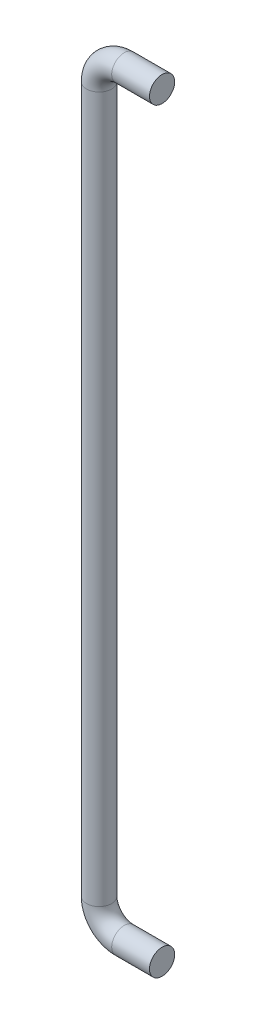
ISO-10303-21;
HEADER;
FILE_DESCRIPTION(('STEP AP214'),'2;1');
FILE_NAME('part.step','',(''),(''),'','','');
FILE_SCHEMA(('AUTOMOTIVE_DESIGN { 1 0 10303 214 1 1 1 1 }'));
ENDSEC;
DATA;
#1=APPLICATION_CONTEXT('core data for automotive mechanical design processes');
#2=APPLICATION_PROTOCOL_DEFINITION('international standard','automotive_design',2000,#1);
#3=PRODUCT_CONTEXT('',#1,'mechanical');
#4=PRODUCT('Part','Part','',(#3));
#5=PRODUCT_RELATED_PRODUCT_CATEGORY('part','',(#4));
#6=PRODUCT_DEFINITION_FORMATION('','',#4);
#7=PRODUCT_DEFINITION_CONTEXT('part definition',#1,'design');
#8=PRODUCT_DEFINITION('design','',#6,#7);
#9=PRODUCT_DEFINITION_SHAPE('','',#8);
#10=(LENGTH_UNIT() NAMED_UNIT(*) SI_UNIT(.MILLI.,.METRE.));
#11=(NAMED_UNIT(*) PLANE_ANGLE_UNIT() SI_UNIT($,.RADIAN.));
#12=(NAMED_UNIT(*) SI_UNIT($,.STERADIAN.) SOLID_ANGLE_UNIT());
#13=UNCERTAINTY_MEASURE_WITH_UNIT(LENGTH_MEASURE(1.E-05),#10,'distance_accuracy_value','');
#14=(GEOMETRIC_REPRESENTATION_CONTEXT(3) GLOBAL_UNCERTAINTY_ASSIGNED_CONTEXT((#13)) GLOBAL_UNIT_ASSIGNED_CONTEXT((#10,
#11,#12)) REPRESENTATION_CONTEXT('',''));
#15=CARTESIAN_POINT('',(0.,0.,0.));
#16=DIRECTION('',(0.,0.,1.));
#17=DIRECTION('',(1.,0.,0.));
#18=AXIS2_PLACEMENT_3D('',#15,#16,#17);
#19=CARTESIAN_POINT('',(25.,-300.,0.));
#20=DIRECTION('',(-1.,0.,0.));
#21=DIRECTION('',(0.,0.,-1.));
#22=AXIS2_PLACEMENT_3D('',#19,#20,#21);
#23=PLANE('',#22);
#24=CARTESIAN_POINT('',(25.,-300.,0.));
#25=DIRECTION('',(-1.,0.,0.));
#26=DIRECTION('',(0.,0.,-1.));
#27=AXIS2_PLACEMENT_3D('',#24,#25,#26);
#28=CIRCLE('',#27,10.);
#29=CARTESIAN_POINT('',(25.,-300.,-10.));
#30=VERTEX_POINT('',#29);
#31=EDGE_CURVE('E56',#30,#30,#28,.T.);
#32=ORIENTED_EDGE('',*,*,#31,.F.);
#33=EDGE_LOOP('',(#32));
#34=FACE_BOUND('',#33,.T.);
#35=ADVANCED_FACE('F34',(#34),#23,.F.);
#36=CARTESIAN_POINT('',(24.9999999999999,300.,0.));
#37=DIRECTION('',(1.,0.,0.));
#38=DIRECTION('',(0.,0.,-1.));
#39=AXIS2_PLACEMENT_3D('',#36,#37,#38);
#40=PLANE('',#39);
#41=CARTESIAN_POINT('',(24.9999999999999,300.,0.));
#42=DIRECTION('',(1.,0.,0.));
#43=DIRECTION('',(0.,0.,-1.));
#44=AXIS2_PLACEMENT_3D('',#41,#42,#43);
#45=CIRCLE('',#44,10.);
#46=CARTESIAN_POINT('',(24.9999999999999,300.,-10.));
#47=VERTEX_POINT('',#46);
#48=EDGE_CURVE('E10',#47,#47,#45,.T.);
#49=ORIENTED_EDGE('',*,*,#48,.T.);
#50=EDGE_LOOP('',(#49));
#51=FACE_BOUND('',#50,.T.);
#52=ADVANCED_FACE('F63',(#51),#40,.T.);
#53=CARTESIAN_POINT('',(25.,-300.,0.));
#54=DIRECTION('',(-1.,0.,0.));
#55=DIRECTION('',(0.,0.,1.));
#56=AXIS2_PLACEMENT_3D('',#53,#54,#55);
#57=CYLINDRICAL_SURFACE('',#56,10.);
#58=CARTESIAN_POINT('',(-4.99999999999983,-300.,0.));
#59=DIRECTION('',(-1.,0.,0.));
#60=DIRECTION('',(0.,0.,-1.));
#61=AXIS2_PLACEMENT_3D('',#58,#59,#60);
#62=CIRCLE('',#61,10.);
#63=CARTESIAN_POINT('',(-4.99999999999976,-310.,0.));
#64=VERTEX_POINT('',#63);
#65=EDGE_CURVE('E53',#64,#64,#62,.T.);
#66=ORIENTED_EDGE('',*,*,#65,.F.);
#67=EDGE_LOOP('',(#66));
#68=FACE_BOUND('',#67,.T.);
#69=ORIENTED_EDGE('',*,*,#31,.T.);
#70=EDGE_LOOP('',(#69));
#71=FACE_BOUND('',#70,.T.);
#72=ADVANCED_FACE('F60',(#68,#71),#57,.T.);
#73=CARTESIAN_POINT('',(-4.99999999999997,-280.,0.));
#74=DIRECTION('',(0.,0.,-1.));
#75=DIRECTION('',(-1.,0.,0.));
#76=AXIS2_PLACEMENT_3D('',#73,#74,#75);
#77=TOROIDAL_SURFACE('',#76,20.,10.);
#78=CARTESIAN_POINT('',(-25.,-280.,0.));
#79=DIRECTION('',(0.,1.,0.));
#80=DIRECTION('',(0.,0.,-1.));
#81=AXIS2_PLACEMENT_3D('',#78,#79,#80);
#82=CIRCLE('',#81,10.);
#83=CARTESIAN_POINT('',(-35.,-280.,0.));
#84=VERTEX_POINT('',#83);
#85=EDGE_CURVE('E48',#84,#84,#82,.T.);
#86=CARTESIAN_POINT('',(-4.99999999999997,-280.,0.));
#87=DIRECTION('',(0.,0.,-1.));
#88=DIRECTION('',(-1.,0.,0.));
#89=AXIS2_PLACEMENT_3D('',#86,#87,#88);
#90=CIRCLE('',#89,30.);
#91=EDGE_CURVE('',#64,#84,#90,.T.);
#92=ORIENTED_EDGE('',*,*,#65,.T.);
#93=ORIENTED_EDGE('',*,*,#85,.F.);
#94=ORIENTED_EDGE('',*,*,#91,.T.);
#95=ORIENTED_EDGE('',*,*,#91,.F.);
#96=EDGE_LOOP('',(#92,#94,#93,#95));
#97=FACE_BOUND('',#96,.T.);
#98=ADVANCED_FACE('F81',(#97),#77,.T.);
#99=CARTESIAN_POINT('',(-25.,-280.,0.));
#100=DIRECTION('',(0.,1.,0.));
#101=DIRECTION('',(-1.,0.,0.));
#102=AXIS2_PLACEMENT_3D('',#99,#100,#101);
#103=CYLINDRICAL_SURFACE('',#102,10.);
#104=CARTESIAN_POINT('',(-25.,280.,0.));
#105=DIRECTION('',(0.,1.,0.));
#106=DIRECTION('',(0.,0.,-1.));
#107=AXIS2_PLACEMENT_3D('',#104,#105,#106);
#108=CIRCLE('',#107,10.);
#109=CARTESIAN_POINT('',(-35.0000000000001,280.,0.));
#110=VERTEX_POINT('',#109);
#111=EDGE_CURVE('E44',#110,#110,#108,.T.);
#112=ORIENTED_EDGE('',*,*,#111,.F.);
#113=EDGE_LOOP('',(#112));
#114=FACE_BOUND('',#113,.T.);
#115=ORIENTED_EDGE('',*,*,#85,.T.);
#116=EDGE_LOOP('',(#115));
#117=FACE_BOUND('',#116,.T.);
#118=ADVANCED_FACE('F75',(#114,#117),#103,.T.);
#119=CARTESIAN_POINT('',(-5.00000000000005,280.,0.));
#120=DIRECTION('',(0.,0.,-1.));
#121=DIRECTION('',(-1.,0.,0.));
#122=AXIS2_PLACEMENT_3D('',#119,#120,#121);
#123=TOROIDAL_SURFACE('',#122,20.,10.);
#124=CARTESIAN_POINT('',(-5.00000000000202,300.,0.));
#125=DIRECTION('',(1.,0.,0.));
#126=DIRECTION('',(0.,0.,-1.));
#127=AXIS2_PLACEMENT_3D('',#124,#125,#126);
#128=CIRCLE('',#127,10.);
#129=CARTESIAN_POINT('',(-5.000000000003,310.,0.));
#130=VERTEX_POINT('',#129);
#131=EDGE_CURVE('E40',#130,#130,#128,.T.);
#132=CARTESIAN_POINT('',(-5.00000000000005,280.,0.));
#133=DIRECTION('',(0.,0.,-1.));
#134=DIRECTION('',(-1.,0.,0.));
#135=AXIS2_PLACEMENT_3D('',#132,#133,#134);
#136=CIRCLE('',#135,30.);
#137=EDGE_CURVE('',#110,#130,#136,.T.);
#138=ORIENTED_EDGE('',*,*,#111,.T.);
#139=ORIENTED_EDGE('',*,*,#131,.F.);
#140=ORIENTED_EDGE('',*,*,#137,.T.);
#141=ORIENTED_EDGE('',*,*,#137,.F.);
#142=EDGE_LOOP('',(#138,#140,#139,#141));
#143=FACE_BOUND('',#142,.T.);
#144=ADVANCED_FACE('F69',(#143),#123,.T.);
#145=CARTESIAN_POINT('',(-4.99999999999991,300.,0.));
#146=DIRECTION('',(1.,0.,0.));
#147=DIRECTION('',(0.,0.,-1.));
#148=AXIS2_PLACEMENT_3D('',#145,#146,#147);
#149=CYLINDRICAL_SURFACE('',#148,10.);
#150=ORIENTED_EDGE('',*,*,#48,.F.);
#151=EDGE_LOOP('',(#150));
#152=FACE_BOUND('',#151,.T.);
#153=ORIENTED_EDGE('',*,*,#131,.T.);
#154=EDGE_LOOP('',(#153));
#155=FACE_BOUND('',#154,.T.);
#156=ADVANCED_FACE('F67',(#152,#155),#149,.T.);
#157=CLOSED_SHELL('',(#35,#52,#72,#98,#118,#144,#156));
#158=MANIFOLD_SOLID_BREP('B2',#157);
#159=ADVANCED_BREP_SHAPE_REPRESENTATION('',(#18,#158),#14);
#160=SHAPE_DEFINITION_REPRESENTATION(#9,#159);
ENDSEC;
END-ISO-10303-21;
